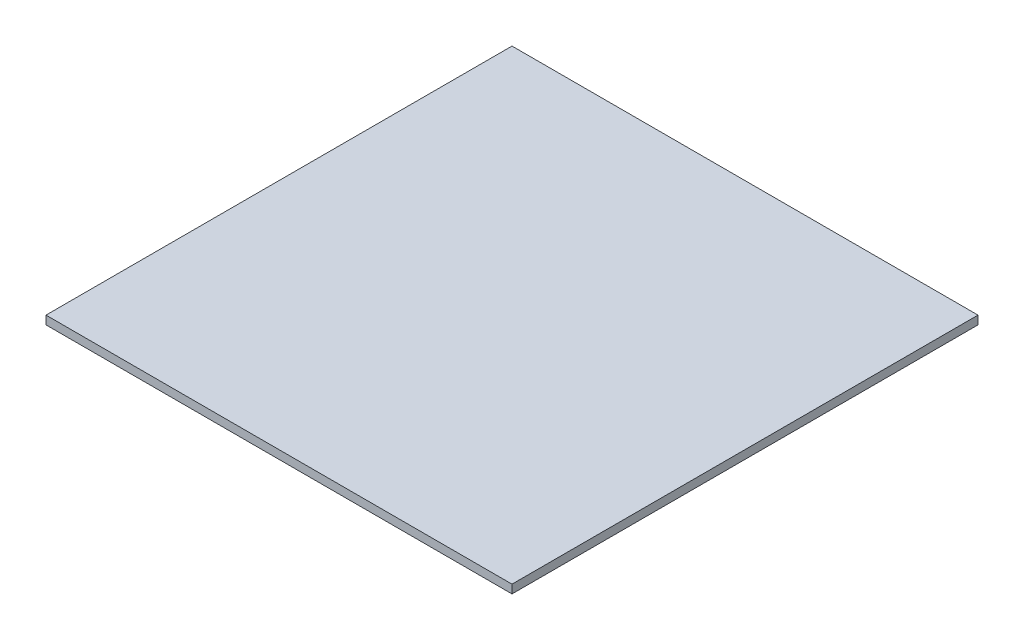
ISO-10303-21;
HEADER;
FILE_DESCRIPTION(('STEP AP214'),'2;1');
FILE_NAME('part.step','',(''),(''),'','','');
FILE_SCHEMA(('AUTOMOTIVE_DESIGN { 1 0 10303 214 1 1 1 1 }'));
ENDSEC;
DATA;
#1=APPLICATION_CONTEXT('core data for automotive mechanical design processes');
#2=APPLICATION_PROTOCOL_DEFINITION('international standard','automotive_design',2000,#1);
#3=PRODUCT_CONTEXT('',#1,'mechanical');
#4=PRODUCT('Part','Part','',(#3));
#5=PRODUCT_RELATED_PRODUCT_CATEGORY('part','',(#4));
#6=PRODUCT_DEFINITION_FORMATION('','',#4);
#7=PRODUCT_DEFINITION_CONTEXT('part definition',#1,'design');
#8=PRODUCT_DEFINITION('design','',#6,#7);
#9=PRODUCT_DEFINITION_SHAPE('','',#8);
#10=(LENGTH_UNIT() NAMED_UNIT(*) SI_UNIT(.MILLI.,.METRE.));
#11=(NAMED_UNIT(*) PLANE_ANGLE_UNIT() SI_UNIT($,.RADIAN.));
#12=(NAMED_UNIT(*) SI_UNIT($,.STERADIAN.) SOLID_ANGLE_UNIT());
#13=UNCERTAINTY_MEASURE_WITH_UNIT(LENGTH_MEASURE(1.E-05),#10,'distance_accuracy_value','');
#14=(GEOMETRIC_REPRESENTATION_CONTEXT(3) GLOBAL_UNCERTAINTY_ASSIGNED_CONTEXT((#13)) GLOBAL_UNIT_ASSIGNED_CONTEXT((#10,
#11,#12)) REPRESENTATION_CONTEXT('',''));
#15=CARTESIAN_POINT('',(0.,0.,0.));
#16=DIRECTION('',(0.,0.,1.));
#17=DIRECTION('',(1.,0.,0.));
#18=AXIS2_PLACEMENT_3D('',#15,#16,#17);
#19=CARTESIAN_POINT('',(-304.8,11.1125,304.8));
#20=DIRECTION('',(1.,0.,0.));
#21=DIRECTION('',(0.,0.,-1.));
#22=AXIS2_PLACEMENT_3D('',#19,#20,#21);
#23=PLANE('',#22);
#24=DIRECTION('',(0.,0.,1.));
#25=VECTOR('',#24,1.);
#26=CARTESIAN_POINT('',(-304.8,0.,304.8));
#27=LINE('',#26,#25);
#28=CARTESIAN_POINT('',(-304.8,0.,-304.8));
#29=VERTEX_POINT('',#28);
#30=CARTESIAN_POINT('',(-304.8,0.,304.8));
#31=VERTEX_POINT('',#30);
#32=EDGE_CURVE('E96',#29,#31,#27,.T.);
#33=ORIENTED_EDGE('',*,*,#32,.T.);
#34=DIRECTION('',(0.,-1.,0.));
#35=VECTOR('',#34,1.);
#36=CARTESIAN_POINT('',(-304.8,11.1125,304.8));
#37=LINE('',#36,#35);
#38=CARTESIAN_POINT('',(-304.8,11.1125,304.8));
#39=VERTEX_POINT('',#38);
#40=EDGE_CURVE('E11',#39,#31,#37,.T.);
#41=ORIENTED_EDGE('',*,*,#40,.F.);
#42=DIRECTION('',(0.,0.,1.));
#43=VECTOR('',#42,1.);
#44=CARTESIAN_POINT('',(-304.8,11.1125,304.8));
#45=LINE('',#44,#43);
#46=CARTESIAN_POINT('',(-304.8,11.1125,-304.8));
#47=VERTEX_POINT('',#46);
#48=EDGE_CURVE('E84',#47,#39,#45,.T.);
#49=ORIENTED_EDGE('',*,*,#48,.F.);
#50=DIRECTION('',(0.,-1.,0.));
#51=VECTOR('',#50,1.);
#52=CARTESIAN_POINT('',(-304.8,11.1125,-304.8));
#53=LINE('',#52,#51);
#54=EDGE_CURVE('E92',#47,#29,#53,.T.);
#55=ORIENTED_EDGE('',*,*,#54,.T.);
#56=EDGE_LOOP('',(#33,#41,#49,#55));
#57=FACE_BOUND('',#56,.T.);
#58=ADVANCED_FACE('F33',(#57),#23,.F.);
#59=CARTESIAN_POINT('',(304.8,11.1125,304.8));
#60=DIRECTION('',(0.,0.,-1.));
#61=DIRECTION('',(-1.,0.,0.));
#62=AXIS2_PLACEMENT_3D('',#59,#60,#61);
#63=PLANE('',#62);
#64=DIRECTION('',(1.,0.,0.));
#65=VECTOR('',#64,1.);
#66=CARTESIAN_POINT('',(304.8,0.,304.8));
#67=LINE('',#66,#65);
#68=CARTESIAN_POINT('',(304.8,0.,304.8));
#69=VERTEX_POINT('',#68);
#70=EDGE_CURVE('E88',#31,#69,#67,.T.);
#71=ORIENTED_EDGE('',*,*,#70,.T.);
#72=DIRECTION('',(0.,-1.,0.));
#73=VECTOR('',#72,1.);
#74=CARTESIAN_POINT('',(304.8,11.1125,304.8));
#75=LINE('',#74,#73);
#76=CARTESIAN_POINT('',(304.8,11.1125,304.8));
#77=VERTEX_POINT('',#76);
#78=EDGE_CURVE('E41',#77,#69,#75,.T.);
#79=ORIENTED_EDGE('',*,*,#78,.F.);
#80=DIRECTION('',(1.,0.,0.));
#81=VECTOR('',#80,1.);
#82=CARTESIAN_POINT('',(304.8,11.1125,304.8));
#83=LINE('',#82,#81);
#84=EDGE_CURVE('E79',#39,#77,#83,.T.);
#85=ORIENTED_EDGE('',*,*,#84,.F.);
#86=ORIENTED_EDGE('',*,*,#40,.T.);
#87=EDGE_LOOP('',(#71,#79,#85,#86));
#88=FACE_BOUND('',#87,.T.);
#89=ADVANCED_FACE('F87',(#88),#63,.F.);
#90=CARTESIAN_POINT('',(304.8,11.1125,304.8));
#91=DIRECTION('',(-1.,0.,0.));
#92=DIRECTION('',(0.,0.,1.));
#93=AXIS2_PLACEMENT_3D('',#90,#91,#92);
#94=PLANE('',#93);
#95=DIRECTION('',(0.,0.,-1.));
#96=VECTOR('',#95,1.);
#97=CARTESIAN_POINT('',(304.8,0.,304.8));
#98=LINE('',#97,#96);
#99=CARTESIAN_POINT('',(304.8,0.,-304.8));
#100=VERTEX_POINT('',#99);
#101=EDGE_CURVE('E66',#69,#100,#98,.T.);
#102=ORIENTED_EDGE('',*,*,#101,.T.);
#103=DIRECTION('',(0.,-1.,0.));
#104=VECTOR('',#103,1.);
#105=CARTESIAN_POINT('',(304.8,11.1125,-304.8));
#106=LINE('',#105,#104);
#107=CARTESIAN_POINT('',(304.8,11.1125,-304.8));
#108=VERTEX_POINT('',#107);
#109=EDGE_CURVE('E89',#108,#100,#106,.T.);
#110=ORIENTED_EDGE('',*,*,#109,.F.);
#111=DIRECTION('',(0.,0.,-1.));
#112=VECTOR('',#111,1.);
#113=CARTESIAN_POINT('',(304.8,11.1125,304.8));
#114=LINE('',#113,#112);
#115=EDGE_CURVE('E82',#77,#108,#114,.T.);
#116=ORIENTED_EDGE('',*,*,#115,.F.);
#117=ORIENTED_EDGE('',*,*,#78,.T.);
#118=EDGE_LOOP('',(#102,#110,#116,#117));
#119=FACE_BOUND('',#118,.T.);
#120=ADVANCED_FACE('F90',(#119),#94,.F.);
#121=CARTESIAN_POINT('',(304.8,11.1125,-304.8));
#122=DIRECTION('',(0.,0.,1.));
#123=DIRECTION('',(1.,0.,0.));
#124=AXIS2_PLACEMENT_3D('',#121,#122,#123);
#125=PLANE('',#124);
#126=DIRECTION('',(-1.,0.,0.));
#127=VECTOR('',#126,1.);
#128=CARTESIAN_POINT('',(304.8,0.,-304.8));
#129=LINE('',#128,#127);
#130=EDGE_CURVE('E72',#100,#29,#129,.T.);
#131=ORIENTED_EDGE('',*,*,#130,.T.);
#132=ORIENTED_EDGE('',*,*,#54,.F.);
#133=DIRECTION('',(-1.,0.,0.));
#134=VECTOR('',#133,1.);
#135=CARTESIAN_POINT('',(304.8,11.1125,-304.8));
#136=LINE('',#135,#134);
#137=EDGE_CURVE('E49',#108,#47,#136,.T.);
#138=ORIENTED_EDGE('',*,*,#137,.F.);
#139=ORIENTED_EDGE('',*,*,#109,.T.);
#140=EDGE_LOOP('',(#131,#132,#138,#139));
#141=FACE_BOUND('',#140,.T.);
#142=ADVANCED_FACE('F103',(#141),#125,.F.);
#143=CARTESIAN_POINT('',(0.,11.1125,0.));
#144=DIRECTION('',(0.,1.,0.));
#145=DIRECTION('',(0.,0.,1.));
#146=AXIS2_PLACEMENT_3D('',#143,#144,#145);
#147=PLANE('',#146);
#148=ORIENTED_EDGE('',*,*,#48,.T.);
#149=ORIENTED_EDGE('',*,*,#84,.T.);
#150=ORIENTED_EDGE('',*,*,#115,.T.);
#151=ORIENTED_EDGE('',*,*,#137,.T.);
#152=EDGE_LOOP('',(#148,#149,#150,#151));
#153=FACE_BOUND('',#152,.T.);
#154=ADVANCED_FACE('F80',(#153),#147,.T.);
#155=CARTESIAN_POINT('',(0.,0.,0.));
#156=DIRECTION('',(0.,1.,0.));
#157=DIRECTION('',(0.,0.,1.));
#158=AXIS2_PLACEMENT_3D('',#155,#156,#157);
#159=PLANE('',#158);
#160=ORIENTED_EDGE('',*,*,#32,.F.);
#161=ORIENTED_EDGE('',*,*,#130,.F.);
#162=ORIENTED_EDGE('',*,*,#101,.F.);
#163=ORIENTED_EDGE('',*,*,#70,.F.);
#164=EDGE_LOOP('',(#160,#161,#162,#163));
#165=FACE_BOUND('',#164,.T.);
#166=ADVANCED_FACE('F106',(#165),#159,.F.);
#167=CLOSED_SHELL('',(#58,#89,#120,#142,#154,#166));
#168=MANIFOLD_SOLID_BREP('B2',#167);
#169=ADVANCED_BREP_SHAPE_REPRESENTATION('',(#18,#168),#14);
#170=SHAPE_DEFINITION_REPRESENTATION(#9,#169);
ENDSEC;
END-ISO-10303-21;
